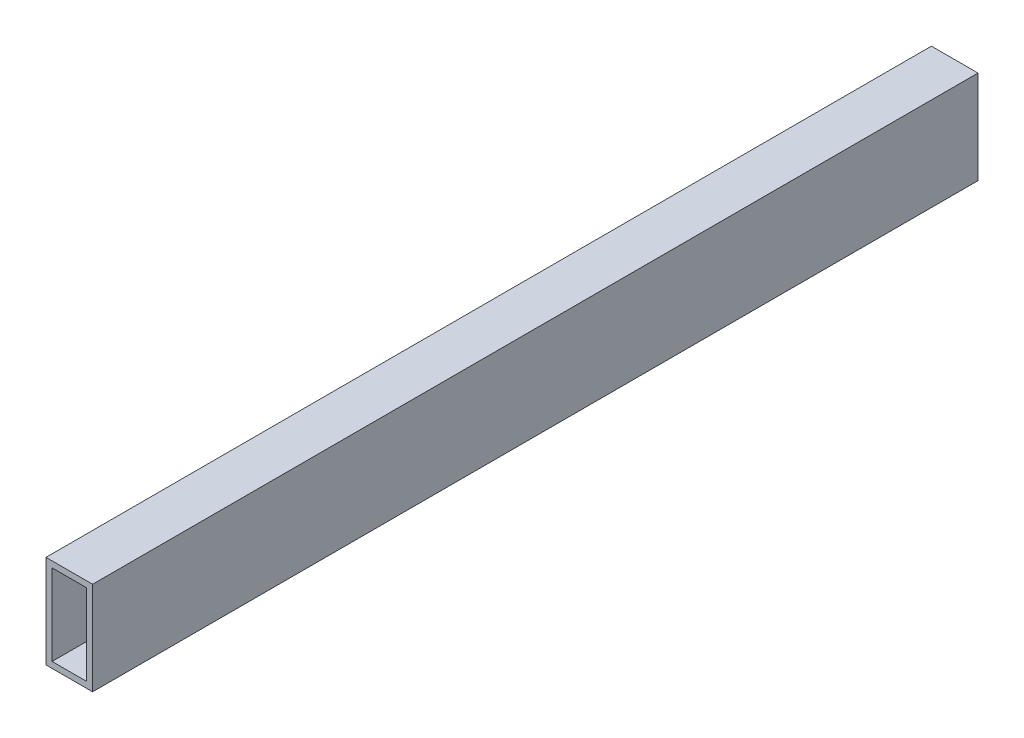
ISO-10303-21;
HEADER;
FILE_DESCRIPTION(('STEP AP214'),'2;1');
FILE_NAME('part.step','',(''),(''),'','','');
FILE_SCHEMA(('AUTOMOTIVE_DESIGN { 1 0 10303 214 1 1 1 1 }'));
ENDSEC;
DATA;
#1=APPLICATION_CONTEXT('core data for automotive mechanical design processes');
#2=APPLICATION_PROTOCOL_DEFINITION('international standard','automotive_design',2000,#1);
#3=PRODUCT_CONTEXT('',#1,'mechanical');
#4=PRODUCT('Part','Part','',(#3));
#5=PRODUCT_RELATED_PRODUCT_CATEGORY('part','',(#4));
#6=PRODUCT_DEFINITION_FORMATION('','',#4);
#7=PRODUCT_DEFINITION_CONTEXT('part definition',#1,'design');
#8=PRODUCT_DEFINITION('design','',#6,#7);
#9=PRODUCT_DEFINITION_SHAPE('','',#8);
#10=(LENGTH_UNIT() NAMED_UNIT(*) SI_UNIT(.MILLI.,.METRE.));
#11=(NAMED_UNIT(*) PLANE_ANGLE_UNIT() SI_UNIT($,.RADIAN.));
#12=(NAMED_UNIT(*) SI_UNIT($,.STERADIAN.) SOLID_ANGLE_UNIT());
#13=UNCERTAINTY_MEASURE_WITH_UNIT(LENGTH_MEASURE(1.E-05),#10,'distance_accuracy_value','');
#14=(GEOMETRIC_REPRESENTATION_CONTEXT(3) GLOBAL_UNCERTAINTY_ASSIGNED_CONTEXT((#13)) GLOBAL_UNIT_ASSIGNED_CONTEXT((#10,
#11,#12)) REPRESENTATION_CONTEXT('',''));
#15=CARTESIAN_POINT('',(0.,0.,0.));
#16=DIRECTION('',(0.,0.,1.));
#17=DIRECTION('',(1.,0.,0.));
#18=AXIS2_PLACEMENT_3D('',#15,#16,#17);
#19=CARTESIAN_POINT('',(0.,0.,482.6));
#20=DIRECTION('',(0.,0.,1.));
#21=DIRECTION('',(1.,0.,0.));
#22=AXIS2_PLACEMENT_3D('',#19,#20,#21);
#23=PLANE('',#22);
#24=DIRECTION('',(0.,1.,0.));
#25=VECTOR('',#24,1.);
#26=CARTESIAN_POINT('',(12.7,25.4,482.6));
#27=LINE('',#26,#25);
#28=CARTESIAN_POINT('',(12.7,-25.4,482.6));
#29=VERTEX_POINT('',#28);
#30=CARTESIAN_POINT('',(12.7,25.4,482.6));
#31=VERTEX_POINT('',#30);
#32=EDGE_CURVE('E140',#29,#31,#27,.T.);
#33=ORIENTED_EDGE('',*,*,#32,.T.);
#34=DIRECTION('',(-1.,0.,0.));
#35=VECTOR('',#34,1.);
#36=CARTESIAN_POINT('',(-12.7,25.4,482.6));
#37=LINE('',#36,#35);
#38=CARTESIAN_POINT('',(-12.7,25.4,482.6));
#39=VERTEX_POINT('',#38);
#40=EDGE_CURVE('E143',#31,#39,#37,.T.);
#41=ORIENTED_EDGE('',*,*,#40,.T.);
#42=DIRECTION('',(0.,-1.,0.));
#43=VECTOR('',#42,1.);
#44=CARTESIAN_POINT('',(-12.7,25.4,482.6));
#45=LINE('',#44,#43);
#46=CARTESIAN_POINT('',(-12.7,-25.4,482.6));
#47=VERTEX_POINT('',#46);
#48=EDGE_CURVE('E146',#39,#47,#45,.T.);
#49=ORIENTED_EDGE('',*,*,#48,.T.);
#50=DIRECTION('',(1.,0.,0.));
#51=VECTOR('',#50,1.);
#52=CARTESIAN_POINT('',(-12.7,-25.4,482.6));
#53=LINE('',#52,#51);
#54=EDGE_CURVE('E148',#47,#29,#53,.T.);
#55=ORIENTED_EDGE('',*,*,#54,.T.);
#56=EDGE_LOOP('',(#33,#41,#49,#55));
#57=FACE_BOUND('',#56,.T.);
#58=DIRECTION('',(-1.,0.,0.));
#59=VECTOR('',#58,1.);
#60=CARTESIAN_POINT('',(-9.398,22.098,482.6));
#61=LINE('',#60,#59);
#62=CARTESIAN_POINT('',(9.398,22.098,482.6));
#63=VERTEX_POINT('',#62);
#64=CARTESIAN_POINT('',(-9.398,22.098,482.6));
#65=VERTEX_POINT('',#64);
#66=EDGE_CURVE('E112',#63,#65,#61,.T.);
#67=ORIENTED_EDGE('',*,*,#66,.F.);
#68=DIRECTION('',(0.,1.,0.));
#69=VECTOR('',#68,1.);
#70=CARTESIAN_POINT('',(9.398,22.098,482.6));
#71=LINE('',#70,#69);
#72=CARTESIAN_POINT('',(9.39800000000001,-22.098,482.6));
#73=VERTEX_POINT('',#72);
#74=EDGE_CURVE('E104',#73,#63,#71,.T.);
#75=ORIENTED_EDGE('',*,*,#74,.F.);
#76=DIRECTION('',(1.,0.,0.));
#77=VECTOR('',#76,1.);
#78=CARTESIAN_POINT('',(-9.398,-22.098,482.6));
#79=LINE('',#78,#77);
#80=CARTESIAN_POINT('',(-9.398,-22.098,482.6));
#81=VERTEX_POINT('',#80);
#82=EDGE_CURVE('E126',#81,#73,#79,.T.);
#83=ORIENTED_EDGE('',*,*,#82,.F.);
#84=DIRECTION('',(0.,-1.,0.));
#85=VECTOR('',#84,1.);
#86=CARTESIAN_POINT('',(-9.398,22.098,482.6));
#87=LINE('',#86,#85);
#88=EDGE_CURVE('E124',#65,#81,#87,.T.);
#89=ORIENTED_EDGE('',*,*,#88,.F.);
#90=EDGE_LOOP('',(#67,#75,#83,#89));
#91=FACE_BOUND('',#90,.T.);
#92=ADVANCED_FACE('F39',(#57,#91),#23,.T.);
#93=CARTESIAN_POINT('',(0.,0.,0.));
#94=DIRECTION('',(0.,0.,1.));
#95=DIRECTION('',(1.,0.,0.));
#96=AXIS2_PLACEMENT_3D('',#93,#94,#95);
#97=PLANE('',#96);
#98=DIRECTION('',(0.,1.,0.));
#99=VECTOR('',#98,1.);
#100=CARTESIAN_POINT('',(12.7,25.4,0.));
#101=LINE('',#100,#99);
#102=CARTESIAN_POINT('',(12.7,-25.4,0.));
#103=VERTEX_POINT('',#102);
#104=CARTESIAN_POINT('',(12.7,25.4,0.));
#105=VERTEX_POINT('',#104);
#106=EDGE_CURVE('E120',#103,#105,#101,.T.);
#107=ORIENTED_EDGE('',*,*,#106,.F.);
#108=DIRECTION('',(1.,0.,0.));
#109=VECTOR('',#108,1.);
#110=CARTESIAN_POINT('',(-12.7,-25.4,0.));
#111=LINE('',#110,#109);
#112=CARTESIAN_POINT('',(-12.7,-25.4,0.));
#113=VERTEX_POINT('',#112);
#114=EDGE_CURVE('E144',#113,#103,#111,.T.);
#115=ORIENTED_EDGE('',*,*,#114,.F.);
#116=DIRECTION('',(0.,-1.,0.));
#117=VECTOR('',#116,1.);
#118=CARTESIAN_POINT('',(-12.7,25.4,0.));
#119=LINE('',#118,#117);
#120=CARTESIAN_POINT('',(-12.7,25.4,0.));
#121=VERTEX_POINT('',#120);
#122=EDGE_CURVE('E155',#121,#113,#119,.T.);
#123=ORIENTED_EDGE('',*,*,#122,.F.);
#124=DIRECTION('',(-1.,0.,0.));
#125=VECTOR('',#124,1.);
#126=CARTESIAN_POINT('',(-12.7,25.4,0.));
#127=LINE('',#126,#125);
#128=EDGE_CURVE('E153',#105,#121,#127,.T.);
#129=ORIENTED_EDGE('',*,*,#128,.F.);
#130=EDGE_LOOP('',(#107,#115,#123,#129));
#131=FACE_BOUND('',#130,.T.);
#132=DIRECTION('',(0.,1.,0.));
#133=VECTOR('',#132,1.);
#134=CARTESIAN_POINT('',(9.398,22.098,0.));
#135=LINE('',#134,#133);
#136=CARTESIAN_POINT('',(9.39800000000001,-22.098,0.));
#137=VERTEX_POINT('',#136);
#138=CARTESIAN_POINT('',(9.398,22.098,0.));
#139=VERTEX_POINT('',#138);
#140=EDGE_CURVE('E62',#137,#139,#135,.T.);
#141=ORIENTED_EDGE('',*,*,#140,.T.);
#142=DIRECTION('',(-1.,0.,0.));
#143=VECTOR('',#142,1.);
#144=CARTESIAN_POINT('',(-9.398,22.098,0.));
#145=LINE('',#144,#143);
#146=CARTESIAN_POINT('',(-9.398,22.098,0.));
#147=VERTEX_POINT('',#146);
#148=EDGE_CURVE('E119',#139,#147,#145,.T.);
#149=ORIENTED_EDGE('',*,*,#148,.T.);
#150=DIRECTION('',(0.,-1.,0.));
#151=VECTOR('',#150,1.);
#152=CARTESIAN_POINT('',(-9.398,22.098,0.));
#153=LINE('',#152,#151);
#154=CARTESIAN_POINT('',(-9.398,-22.098,0.));
#155=VERTEX_POINT('',#154);
#156=EDGE_CURVE('E132',#147,#155,#153,.T.);
#157=ORIENTED_EDGE('',*,*,#156,.T.);
#158=DIRECTION('',(1.,0.,0.));
#159=VECTOR('',#158,1.);
#160=CARTESIAN_POINT('',(-9.398,-22.098,0.));
#161=LINE('',#160,#159);
#162=EDGE_CURVE('E113',#155,#137,#161,.T.);
#163=ORIENTED_EDGE('',*,*,#162,.T.);
#164=EDGE_LOOP('',(#141,#149,#157,#163));
#165=FACE_BOUND('',#164,.T.);
#166=ADVANCED_FACE('F173',(#131,#165),#97,.F.);
#167=CARTESIAN_POINT('',(12.7,25.4,482.6));
#168=DIRECTION('',(-1.,0.,0.));
#169=DIRECTION('',(0.,-1.,0.));
#170=AXIS2_PLACEMENT_3D('',#167,#168,#169);
#171=PLANE('',#170);
#172=ORIENTED_EDGE('',*,*,#106,.T.);
#173=DIRECTION('',(0.,0.,-1.));
#174=VECTOR('',#173,1.);
#175=CARTESIAN_POINT('',(12.7,25.4,482.6));
#176=LINE('',#175,#174);
#177=EDGE_CURVE('E11',#31,#105,#176,.T.);
#178=ORIENTED_EDGE('',*,*,#177,.F.);
#179=ORIENTED_EDGE('',*,*,#32,.F.);
#180=DIRECTION('',(0.,0.,-1.));
#181=VECTOR('',#180,1.);
#182=CARTESIAN_POINT('',(12.7,-25.4,482.6));
#183=LINE('',#182,#181);
#184=EDGE_CURVE('E150',#29,#103,#183,.T.);
#185=ORIENTED_EDGE('',*,*,#184,.T.);
#186=EDGE_LOOP('',(#172,#178,#179,#185));
#187=FACE_BOUND('',#186,.T.);
#188=ADVANCED_FACE('F41',(#187),#171,.F.);
#189=CARTESIAN_POINT('',(-12.7,25.4,482.6));
#190=DIRECTION('',(0.,-1.,0.));
#191=DIRECTION('',(0.,0.,-1.));
#192=AXIS2_PLACEMENT_3D('',#189,#190,#191);
#193=PLANE('',#192);
#194=ORIENTED_EDGE('',*,*,#128,.T.);
#195=DIRECTION('',(0.,0.,-1.));
#196=VECTOR('',#195,1.);
#197=CARTESIAN_POINT('',(-12.7,25.4,482.6));
#198=LINE('',#197,#196);
#199=EDGE_CURVE('E47',#39,#121,#198,.T.);
#200=ORIENTED_EDGE('',*,*,#199,.F.);
#201=ORIENTED_EDGE('',*,*,#40,.F.);
#202=ORIENTED_EDGE('',*,*,#177,.T.);
#203=EDGE_LOOP('',(#194,#200,#201,#202));
#204=FACE_BOUND('',#203,.T.);
#205=ADVANCED_FACE('F183',(#204),#193,.F.);
#206=CARTESIAN_POINT('',(-12.7,25.4,482.6));
#207=DIRECTION('',(1.,0.,0.));
#208=DIRECTION('',(0.,1.,0.));
#209=AXIS2_PLACEMENT_3D('',#206,#207,#208);
#210=PLANE('',#209);
#211=ORIENTED_EDGE('',*,*,#122,.T.);
#212=DIRECTION('',(0.,0.,-1.));
#213=VECTOR('',#212,1.);
#214=CARTESIAN_POINT('',(-12.7,-25.4,482.6));
#215=LINE('',#214,#213);
#216=EDGE_CURVE('E160',#47,#113,#215,.T.);
#217=ORIENTED_EDGE('',*,*,#216,.F.);
#218=ORIENTED_EDGE('',*,*,#48,.F.);
#219=ORIENTED_EDGE('',*,*,#199,.T.);
#220=EDGE_LOOP('',(#211,#217,#218,#219));
#221=FACE_BOUND('',#220,.T.);
#222=ADVANCED_FACE('F167',(#221),#210,.F.);
#223=CARTESIAN_POINT('',(-12.7,-25.4,482.6));
#224=DIRECTION('',(0.,1.,0.));
#225=DIRECTION('',(0.,0.,1.));
#226=AXIS2_PLACEMENT_3D('',#223,#224,#225);
#227=PLANE('',#226);
#228=ORIENTED_EDGE('',*,*,#114,.T.);
#229=ORIENTED_EDGE('',*,*,#184,.F.);
#230=ORIENTED_EDGE('',*,*,#54,.F.);
#231=ORIENTED_EDGE('',*,*,#216,.T.);
#232=EDGE_LOOP('',(#228,#229,#230,#231));
#233=FACE_BOUND('',#232,.T.);
#234=ADVANCED_FACE('F177',(#233),#227,.F.);
#235=CARTESIAN_POINT('',(9.398,22.098,482.6));
#236=DIRECTION('',(-1.,0.,0.));
#237=DIRECTION('',(0.,-1.,0.));
#238=AXIS2_PLACEMENT_3D('',#235,#236,#237);
#239=PLANE('',#238);
#240=ORIENTED_EDGE('',*,*,#140,.F.);
#241=DIRECTION('',(0.,0.,-1.));
#242=VECTOR('',#241,1.);
#243=CARTESIAN_POINT('',(9.39800000000001,-22.098,482.6));
#244=LINE('',#243,#242);
#245=EDGE_CURVE('E108',#73,#137,#244,.T.);
#246=ORIENTED_EDGE('',*,*,#245,.F.);
#247=ORIENTED_EDGE('',*,*,#74,.T.);
#248=DIRECTION('',(0.,0.,-1.));
#249=VECTOR('',#248,1.);
#250=CARTESIAN_POINT('',(9.398,22.098,482.6));
#251=LINE('',#250,#249);
#252=EDGE_CURVE('E107',#63,#139,#251,.T.);
#253=ORIENTED_EDGE('',*,*,#252,.T.);
#254=EDGE_LOOP('',(#240,#246,#247,#253));
#255=FACE_BOUND('',#254,.T.);
#256=ADVANCED_FACE('F106',(#255),#239,.T.);
#257=CARTESIAN_POINT('',(-9.398,22.098,482.6));
#258=DIRECTION('',(0.,-1.,0.));
#259=DIRECTION('',(0.,0.,-1.));
#260=AXIS2_PLACEMENT_3D('',#257,#258,#259);
#261=PLANE('',#260);
#262=ORIENTED_EDGE('',*,*,#148,.F.);
#263=ORIENTED_EDGE('',*,*,#252,.F.);
#264=ORIENTED_EDGE('',*,*,#66,.T.);
#265=DIRECTION('',(0.,0.,-1.));
#266=VECTOR('',#265,1.);
#267=CARTESIAN_POINT('',(-9.398,22.098,482.6));
#268=LINE('',#267,#266);
#269=EDGE_CURVE('E121',#65,#147,#268,.T.);
#270=ORIENTED_EDGE('',*,*,#269,.T.);
#271=EDGE_LOOP('',(#262,#263,#264,#270));
#272=FACE_BOUND('',#271,.T.);
#273=ADVANCED_FACE('F116',(#272),#261,.T.);
#274=CARTESIAN_POINT('',(-9.398,22.098,482.6));
#275=DIRECTION('',(1.,0.,0.));
#276=DIRECTION('',(0.,1.,0.));
#277=AXIS2_PLACEMENT_3D('',#274,#275,#276);
#278=PLANE('',#277);
#279=ORIENTED_EDGE('',*,*,#156,.F.);
#280=ORIENTED_EDGE('',*,*,#269,.F.);
#281=ORIENTED_EDGE('',*,*,#88,.T.);
#282=DIRECTION('',(0.,0.,-1.));
#283=VECTOR('',#282,1.);
#284=CARTESIAN_POINT('',(-9.398,-22.098,482.6));
#285=LINE('',#284,#283);
#286=EDGE_CURVE('E54',#81,#155,#285,.T.);
#287=ORIENTED_EDGE('',*,*,#286,.T.);
#288=EDGE_LOOP('',(#279,#280,#281,#287));
#289=FACE_BOUND('',#288,.T.);
#290=ADVANCED_FACE('F206',(#289),#278,.T.);
#291=CARTESIAN_POINT('',(-9.398,-22.098,482.6));
#292=DIRECTION('',(0.,1.,0.));
#293=DIRECTION('',(0.,0.,1.));
#294=AXIS2_PLACEMENT_3D('',#291,#292,#293);
#295=PLANE('',#294);
#296=ORIENTED_EDGE('',*,*,#162,.F.);
#297=ORIENTED_EDGE('',*,*,#286,.F.);
#298=ORIENTED_EDGE('',*,*,#82,.T.);
#299=ORIENTED_EDGE('',*,*,#245,.T.);
#300=EDGE_LOOP('',(#296,#297,#298,#299));
#301=FACE_BOUND('',#300,.T.);
#302=ADVANCED_FACE('F210',(#301),#295,.T.);
#303=CLOSED_SHELL('',(#92,#166,#188,#205,#222,#234,#256,#273,#290,#302));
#304=MANIFOLD_SOLID_BREP('B2',#303);
#305=ADVANCED_BREP_SHAPE_REPRESENTATION('',(#18,#304),#14);
#306=SHAPE_DEFINITION_REPRESENTATION(#9,#305);
ENDSEC;
END-ISO-10303-21;
